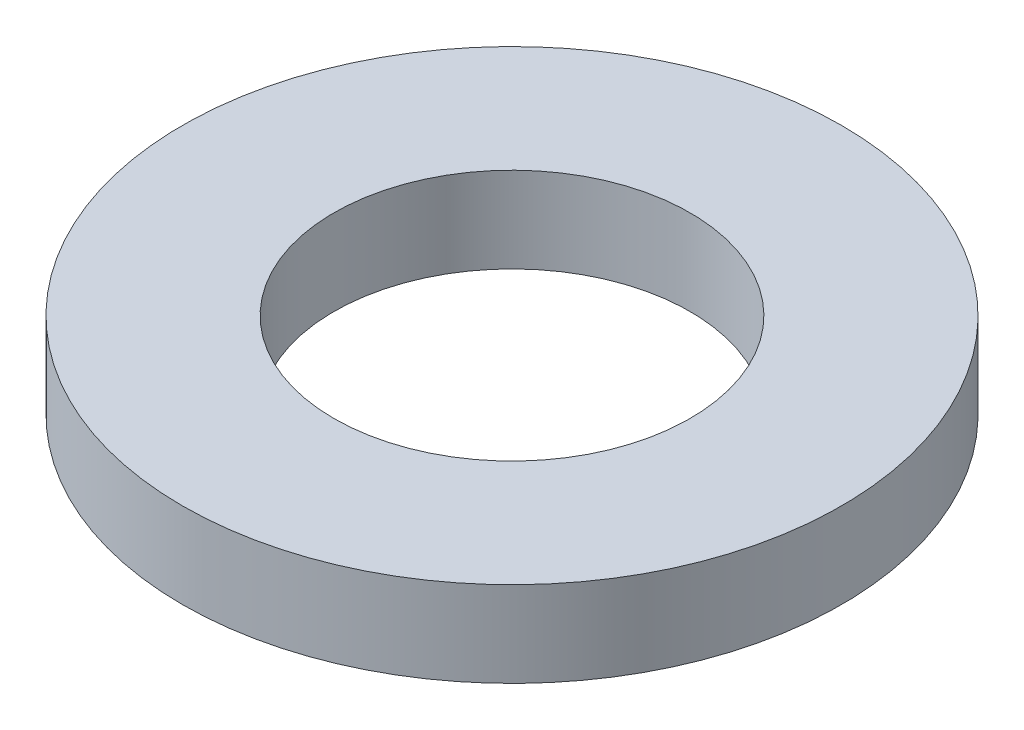
ISO-10303-21;
HEADER;
FILE_DESCRIPTION(('STEP AP214'),'2;1');
FILE_NAME('part.step','',(''),(''),'','','');
FILE_SCHEMA(('AUTOMOTIVE_DESIGN { 1 0 10303 214 1 1 1 1 }'));
ENDSEC;
DATA;
#1=APPLICATION_CONTEXT('core data for automotive mechanical design processes');
#2=APPLICATION_PROTOCOL_DEFINITION('international standard','automotive_design',2000,#1);
#3=PRODUCT_CONTEXT('',#1,'mechanical');
#4=PRODUCT('Part','Part','',(#3));
#5=PRODUCT_RELATED_PRODUCT_CATEGORY('part','',(#4));
#6=PRODUCT_DEFINITION_FORMATION('','',#4);
#7=PRODUCT_DEFINITION_CONTEXT('part definition',#1,'design');
#8=PRODUCT_DEFINITION('design','',#6,#7);
#9=PRODUCT_DEFINITION_SHAPE('','',#8);
#10=(LENGTH_UNIT() NAMED_UNIT(*) SI_UNIT(.MILLI.,.METRE.));
#11=(NAMED_UNIT(*) PLANE_ANGLE_UNIT() SI_UNIT($,.RADIAN.));
#12=(NAMED_UNIT(*) SI_UNIT($,.STERADIAN.) SOLID_ANGLE_UNIT());
#13=UNCERTAINTY_MEASURE_WITH_UNIT(LENGTH_MEASURE(1.E-05),#10,'distance_accuracy_value','');
#14=(GEOMETRIC_REPRESENTATION_CONTEXT(3) GLOBAL_UNCERTAINTY_ASSIGNED_CONTEXT((#13)) GLOBAL_UNIT_ASSIGNED_CONTEXT((#10,
#11,#12)) REPRESENTATION_CONTEXT('',''));
#15=CARTESIAN_POINT('',(0.,0.,0.));
#16=DIRECTION('',(0.,0.,1.));
#17=DIRECTION('',(1.,0.,0.));
#18=AXIS2_PLACEMENT_3D('',#15,#16,#17);
#19=CARTESIAN_POINT('',(0.,24.,0.));
#20=DIRECTION('',(0.,-1.,0.));
#21=DIRECTION('',(0.,0.,-1.));
#22=AXIS2_PLACEMENT_3D('',#19,#20,#21);
#23=CYLINDRICAL_SURFACE('',#22,92.5);
#24=CARTESIAN_POINT('',(0.,24.,0.));
#25=DIRECTION('',(0.,1.,0.));
#26=DIRECTION('',(0.,0.,1.));
#27=AXIS2_PLACEMENT_3D('',#24,#25,#26);
#28=CIRCLE('',#27,92.5);
#29=CARTESIAN_POINT('',(0.,24.,92.5));
#30=VERTEX_POINT('',#29);
#31=EDGE_CURVE('E10',#30,#30,#28,.T.);
#32=ORIENTED_EDGE('',*,*,#31,.F.);
#33=EDGE_LOOP('',(#32));
#34=FACE_BOUND('',#33,.T.);
#35=CARTESIAN_POINT('',(0.,0.,0.));
#36=DIRECTION('',(0.,1.,0.));
#37=DIRECTION('',(0.,0.,1.));
#38=AXIS2_PLACEMENT_3D('',#35,#36,#37);
#39=CIRCLE('',#38,92.5);
#40=CARTESIAN_POINT('',(0.,0.,92.5));
#41=VERTEX_POINT('',#40);
#42=EDGE_CURVE('E37',#41,#41,#39,.T.);
#43=ORIENTED_EDGE('',*,*,#42,.T.);
#44=EDGE_LOOP('',(#43));
#45=FACE_BOUND('',#44,.T.);
#46=ADVANCED_FACE('F40',(#34,#45),#23,.T.);
#47=CARTESIAN_POINT('',(0.,24.,0.));
#48=DIRECTION('',(0.,1.,0.));
#49=DIRECTION('',(0.,0.,1.));
#50=AXIS2_PLACEMENT_3D('',#47,#48,#49);
#51=PLANE('',#50);
#52=CARTESIAN_POINT('',(0.,24.,0.));
#53=DIRECTION('',(0.,1.,0.));
#54=DIRECTION('',(0.,0.,1.));
#55=AXIS2_PLACEMENT_3D('',#52,#53,#54);
#56=CIRCLE('',#55,50.);
#57=CARTESIAN_POINT('',(0.,24.,50.));
#58=VERTEX_POINT('',#57);
#59=EDGE_CURVE('E50',#58,#58,#56,.T.);
#60=ORIENTED_EDGE('',*,*,#59,.F.);
#61=EDGE_LOOP('',(#60));
#62=FACE_BOUND('',#61,.T.);
#63=ORIENTED_EDGE('',*,*,#31,.T.);
#64=EDGE_LOOP('',(#63));
#65=FACE_BOUND('',#64,.T.);
#66=ADVANCED_FACE('F59',(#62,#65),#51,.T.);
#67=CARTESIAN_POINT('',(0.,0.,0.));
#68=DIRECTION('',(0.,1.,0.));
#69=DIRECTION('',(0.,0.,1.));
#70=AXIS2_PLACEMENT_3D('',#67,#68,#69);
#71=PLANE('',#70);
#72=CARTESIAN_POINT('',(0.,0.,0.));
#73=DIRECTION('',(0.,1.,0.));
#74=DIRECTION('',(0.,0.,1.));
#75=AXIS2_PLACEMENT_3D('',#72,#73,#74);
#76=CIRCLE('',#75,50.);
#77=CARTESIAN_POINT('',(0.,0.,50.));
#78=VERTEX_POINT('',#77);
#79=EDGE_CURVE('E47',#78,#78,#76,.T.);
#80=ORIENTED_EDGE('',*,*,#79,.T.);
#81=EDGE_LOOP('',(#80));
#82=FACE_BOUND('',#81,.T.);
#83=ORIENTED_EDGE('',*,*,#42,.F.);
#84=EDGE_LOOP('',(#83));
#85=FACE_BOUND('',#84,.T.);
#86=ADVANCED_FACE('F58',(#82,#85),#71,.F.);
#87=CARTESIAN_POINT('',(0.,24.,0.));
#88=DIRECTION('',(0.,-1.,0.));
#89=DIRECTION('',(0.,0.,-1.));
#90=AXIS2_PLACEMENT_3D('',#87,#88,#89);
#91=CYLINDRICAL_SURFACE('',#90,50.);
#92=ORIENTED_EDGE('',*,*,#59,.T.);
#93=EDGE_LOOP('',(#92));
#94=FACE_BOUND('',#93,.T.);
#95=ORIENTED_EDGE('',*,*,#79,.F.);
#96=EDGE_LOOP('',(#95));
#97=FACE_BOUND('',#96,.T.);
#98=ADVANCED_FACE('F54',(#94,#97),#91,.F.);
#99=CLOSED_SHELL('',(#46,#66,#86,#98));
#100=MANIFOLD_SOLID_BREP('B2',#99);
#101=ADVANCED_BREP_SHAPE_REPRESENTATION('',(#18,#100),#14);
#102=SHAPE_DEFINITION_REPRESENTATION(#9,#101);
ENDSEC;
END-ISO-10303-21;
